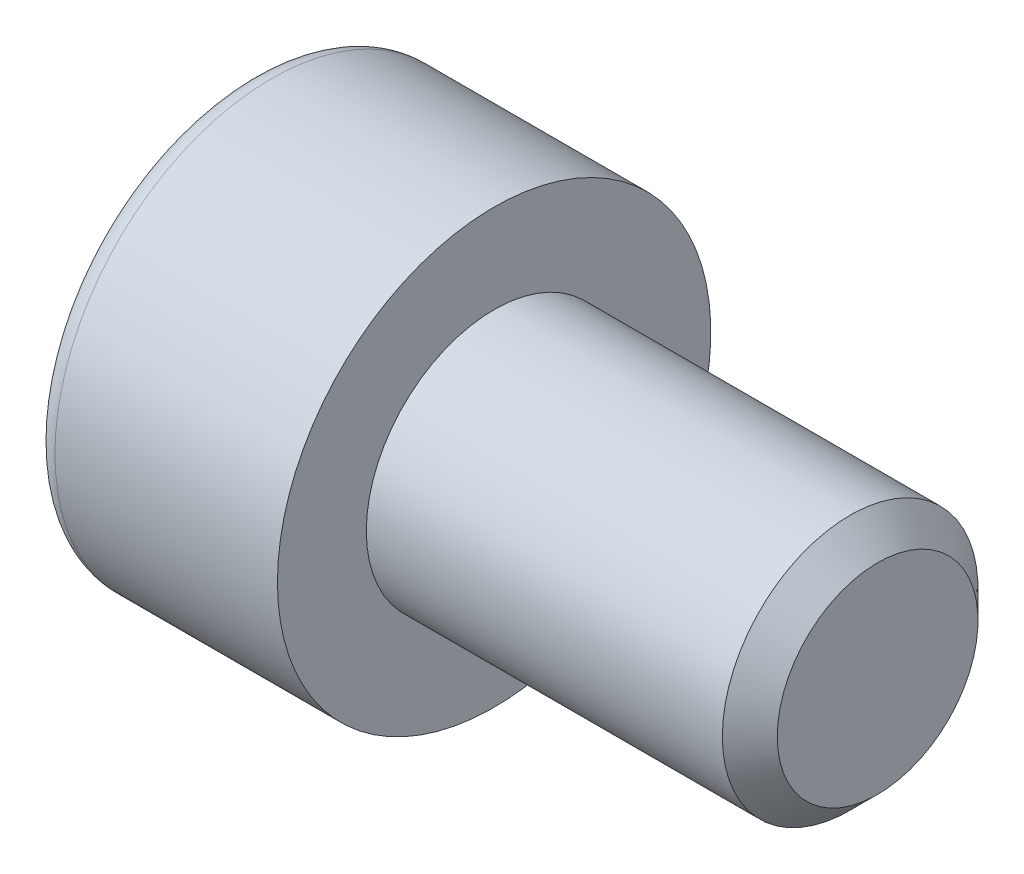
ISO-10303-21;
HEADER;
FILE_DESCRIPTION(('STEP AP214'),'2;1');
FILE_NAME('part.step','',(''),(''),'','','');
FILE_SCHEMA(('AUTOMOTIVE_DESIGN { 1 0 10303 214 1 1 1 1 }'));
ENDSEC;
DATA;
#1=APPLICATION_CONTEXT('core data for automotive mechanical design processes');
#2=APPLICATION_PROTOCOL_DEFINITION('international standard','automotive_design',2000,#1);
#3=PRODUCT_CONTEXT('',#1,'mechanical');
#4=PRODUCT('Part','Part','',(#3));
#5=PRODUCT_RELATED_PRODUCT_CATEGORY('part','',(#4));
#6=PRODUCT_DEFINITION_FORMATION('','',#4);
#7=PRODUCT_DEFINITION_CONTEXT('part definition',#1,'design');
#8=PRODUCT_DEFINITION('design','',#6,#7);
#9=PRODUCT_DEFINITION_SHAPE('','',#8);
#10=(LENGTH_UNIT() NAMED_UNIT(*) SI_UNIT(.MILLI.,.METRE.));
#11=(NAMED_UNIT(*) PLANE_ANGLE_UNIT() SI_UNIT($,.RADIAN.));
#12=(NAMED_UNIT(*) SI_UNIT($,.STERADIAN.) SOLID_ANGLE_UNIT());
#13=UNCERTAINTY_MEASURE_WITH_UNIT(LENGTH_MEASURE(1.E-05),#10,'distance_accuracy_value','');
#14=(GEOMETRIC_REPRESENTATION_CONTEXT(3) GLOBAL_UNCERTAINTY_ASSIGNED_CONTEXT((#13)) GLOBAL_UNIT_ASSIGNED_CONTEXT((#10,
#11,#12)) REPRESENTATION_CONTEXT('',''));
#15=CARTESIAN_POINT('',(0.,0.,0.));
#16=DIRECTION('',(0.,0.,1.));
#17=DIRECTION('',(1.,0.,0.));
#18=AXIS2_PLACEMENT_3D('',#15,#16,#17);
#19=CARTESIAN_POINT('',(0.,0.,0.));
#20=DIRECTION('',(-1.,0.,0.));
#21=DIRECTION('',(0.,0.,1.));
#22=AXIS2_PLACEMENT_3D('',#19,#20,#21);
#23=PLANE('',#22);
#24=CARTESIAN_POINT('',(0.,0.,0.));
#25=DIRECTION('',(-1.,0.,0.));
#26=DIRECTION('',(0.,0.,1.));
#27=AXIS2_PLACEMENT_3D('',#24,#25,#26);
#28=CIRCLE('',#27,3.39);
#29=CARTESIAN_POINT('',(0.,0.,3.39));
#30=VERTEX_POINT('',#29);
#31=EDGE_CURVE('E108',#30,#30,#28,.T.);
#32=ORIENTED_EDGE('',*,*,#31,.F.);
#33=EDGE_LOOP('',(#32));
#34=FACE_BOUND('',#33,.T.);
#35=CARTESIAN_POINT('',(0.,0.,0.));
#36=DIRECTION('',(-1.,0.,0.));
#37=DIRECTION('',(0.,0.,1.));
#38=AXIS2_PLACEMENT_3D('',#35,#36,#37);
#39=CIRCLE('',#38,2.);
#40=CARTESIAN_POINT('',(0.,0.,2.));
#41=VERTEX_POINT('',#40);
#42=EDGE_CURVE('E11',#41,#41,#39,.F.);
#43=ORIENTED_EDGE('',*,*,#42,.F.);
#44=EDGE_LOOP('',(#43));
#45=FACE_BOUND('',#44,.T.);
#46=ADVANCED_FACE('F16',(#34,#45),#23,.F.);
#47=CARTESIAN_POINT('',(-3.82,3.051,0.));
#48=DIRECTION('',(1.,0.,0.));
#49=DIRECTION('',(0.,0.,-1.));
#50=AXIS2_PLACEMENT_3D('',#47,#48,#49);
#51=PLANE('',#50);
#52=CARTESIAN_POINT('',(-3.82,0.,0.));
#53=DIRECTION('',(-1.,0.,0.));
#54=DIRECTION('',(0.,0.,1.));
#55=AXIS2_PLACEMENT_3D('',#52,#53,#54);
#56=CIRCLE('',#55,3.051);
#57=CARTESIAN_POINT('',(-3.82,0.,3.051));
#58=VERTEX_POINT('',#57);
#59=EDGE_CURVE('E91',#58,#58,#56,.T.);
#60=ORIENTED_EDGE('',*,*,#59,.T.);
#61=EDGE_LOOP('',(#60));
#62=FACE_BOUND('',#61,.T.);
#63=DIRECTION('',(0.,0.5,0.866025403784439));
#64=VECTOR('',#63,1.);
#65=CARTESIAN_POINT('',(-3.82,-0.536288105676657,2.07112175347316));
#66=LINE('',#65,#64);
#67=CARTESIAN_POINT('',(-3.82,-1.73205080756888,0.));
#68=VERTEX_POINT('',#67);
#69=CARTESIAN_POINT('',(-3.82,-0.866025403784438,1.5));
#70=VERTEX_POINT('',#69);
#71=EDGE_CURVE('E25',#68,#70,#66,.T.);
#72=ORIENTED_EDGE('',*,*,#71,.F.);
#73=DIRECTION('',(0.,-0.5,0.866025403784439));
#74=VECTOR('',#73,1.);
#75=CARTESIAN_POINT('',(-3.82,-0.536288105676658,-2.07112175347316));
#76=LINE('',#75,#74);
#77=CARTESIAN_POINT('',(-3.82,-0.866025403784439,-1.5));
#78=VERTEX_POINT('',#77);
#79=EDGE_CURVE('E40',#78,#68,#76,.T.);
#80=ORIENTED_EDGE('',*,*,#79,.F.);
#81=DIRECTION('',(0.,-1.,0.));
#82=VECTOR('',#81,1.);
#83=CARTESIAN_POINT('',(-3.82,3.051,-1.5));
#84=LINE('',#83,#82);
#85=CARTESIAN_POINT('',(-3.82,0.866025403784438,-1.5));
#86=VERTEX_POINT('',#85);
#87=EDGE_CURVE('E121',#86,#78,#84,.T.);
#88=ORIENTED_EDGE('',*,*,#87,.F.);
#89=DIRECTION('',(0.,-0.5,-0.866025403784439));
#90=VECTOR('',#89,1.);
#91=CARTESIAN_POINT('',(-3.82,2.06178810567666,0.571121753473161));
#92=LINE('',#91,#90);
#93=CARTESIAN_POINT('',(-3.82,1.73205080756887,0.));
#94=VERTEX_POINT('',#93);
#95=EDGE_CURVE('E118',#94,#86,#92,.T.);
#96=ORIENTED_EDGE('',*,*,#95,.F.);
#97=DIRECTION('',(0.,0.5,-0.866025403784439));
#98=VECTOR('',#97,1.);
#99=CARTESIAN_POINT('',(-3.82,2.06178810567665,-0.571121753473161));
#100=LINE('',#99,#98);
#101=CARTESIAN_POINT('',(-3.82,0.866025403784439,1.5));
#102=VERTEX_POINT('',#101);
#103=EDGE_CURVE('E115',#102,#94,#100,.T.);
#104=ORIENTED_EDGE('',*,*,#103,.F.);
#105=DIRECTION('',(0.,1.,0.));
#106=VECTOR('',#105,1.);
#107=CARTESIAN_POINT('',(-3.82,3.051,1.5));
#108=LINE('',#107,#106);
#109=EDGE_CURVE('E112',#70,#102,#108,.T.);
#110=ORIENTED_EDGE('',*,*,#109,.F.);
#111=EDGE_LOOP('',(#72,#80,#88,#96,#104,#110));
#112=FACE_BOUND('',#111,.T.);
#113=ADVANCED_FACE('F18',(#62,#112),#51,.F.);
#114=CARTESIAN_POINT('',(-3.82,0.,0.));
#115=DIRECTION('',(-1.,0.,0.));
#116=DIRECTION('',(0.,0.,1.));
#117=AXIS2_PLACEMENT_3D('',#114,#115,#116);
#118=CYLINDRICAL_SURFACE('',#117,3.39);
#119=CARTESIAN_POINT('',(-3.481,0.,0.));
#120=DIRECTION('',(-1.,0.,0.));
#121=DIRECTION('',(0.,0.,1.));
#122=AXIS2_PLACEMENT_3D('',#119,#120,#121);
#123=CIRCLE('',#122,3.39);
#124=CARTESIAN_POINT('',(-3.481,0.,3.39));
#125=VERTEX_POINT('',#124);
#126=EDGE_CURVE('E98',#125,#125,#123,.T.);
#127=ORIENTED_EDGE('',*,*,#126,.F.);
#128=EDGE_LOOP('',(#127));
#129=FACE_BOUND('',#128,.T.);
#130=ORIENTED_EDGE('',*,*,#31,.T.);
#131=EDGE_LOOP('',(#130));
#132=FACE_BOUND('',#131,.T.);
#133=ADVANCED_FACE('F202',(#129,#132),#118,.T.);
#134=CARTESIAN_POINT('',(-3.481,0.,0.));
#135=DIRECTION('',(-1.,0.,0.));
#136=DIRECTION('',(0.,0.,1.));
#137=AXIS2_PLACEMENT_3D('',#134,#135,#136);
#138=TOROIDAL_SURFACE('',#137,3.051,0.339);
#139=ORIENTED_EDGE('',*,*,#59,.F.);
#140=EDGE_LOOP('',(#139));
#141=FACE_BOUND('',#140,.T.);
#142=ORIENTED_EDGE('',*,*,#126,.T.);
#143=EDGE_LOOP('',(#142));
#144=FACE_BOUND('',#143,.T.);
#145=ADVANCED_FACE('F209',(#141,#144),#138,.T.);
#146=CARTESIAN_POINT('',(-1.82,-0.866025403784437,1.5));
#147=DIRECTION('',(0.,0.866025403784439,-0.5));
#148=DIRECTION('',(0.,0.5,0.866025403784439));
#149=AXIS2_PLACEMENT_3D('',#146,#147,#148);
#150=PLANE('',#149);
#151=ORIENTED_EDGE('',*,*,#71,.T.);
#152=DIRECTION('',(-1.,0.,0.));
#153=VECTOR('',#152,1.);
#154=CARTESIAN_POINT('',(-1.82,-0.866025403784437,1.5));
#155=LINE('',#154,#153);
#156=CARTESIAN_POINT('',(-1.82,-0.866025403784437,1.5));
#157=VERTEX_POINT('',#156);
#158=EDGE_CURVE('E32',#157,#70,#155,.T.);
#159=ORIENTED_EDGE('',*,*,#158,.F.);
#160=DIRECTION('',(0.,-0.5,-0.866025403784438));
#161=VECTOR('',#160,1.);
#162=CARTESIAN_POINT('',(-1.82,-0.866025403784437,1.5));
#163=LINE('',#162,#161);
#164=CARTESIAN_POINT('',(-1.82,-1.73205080756888,0.));
#165=VERTEX_POINT('',#164);
#166=EDGE_CURVE('E76',#157,#165,#163,.T.);
#167=ORIENTED_EDGE('',*,*,#166,.T.);
#168=DIRECTION('',(-1.,0.,0.));
#169=VECTOR('',#168,1.);
#170=CARTESIAN_POINT('',(-1.82,-1.73205080756888,0.));
#171=LINE('',#170,#169);
#172=EDGE_CURVE('E84',#165,#68,#171,.T.);
#173=ORIENTED_EDGE('',*,*,#172,.T.);
#174=EDGE_LOOP('',(#151,#159,#167,#173));
#175=FACE_BOUND('',#174,.T.);
#176=ADVANCED_FACE('F83',(#175),#150,.T.);
#177=CARTESIAN_POINT('',(-1.82,-1.73205080756888,0.));
#178=DIRECTION('',(0.,0.866025403784439,0.5));
#179=DIRECTION('',(0.,-0.5,0.866025403784439));
#180=AXIS2_PLACEMENT_3D('',#177,#178,#179);
#181=PLANE('',#180);
#182=ORIENTED_EDGE('',*,*,#79,.T.);
#183=ORIENTED_EDGE('',*,*,#172,.F.);
#184=DIRECTION('',(0.,0.5,-0.866025403784439));
#185=VECTOR('',#184,1.);
#186=CARTESIAN_POINT('',(-1.82,-1.73205080756888,0.));
#187=LINE('',#186,#185);
#188=CARTESIAN_POINT('',(-1.82,-0.866025403784439,-1.5));
#189=VERTEX_POINT('',#188);
#190=EDGE_CURVE('E72',#165,#189,#187,.T.);
#191=ORIENTED_EDGE('',*,*,#190,.T.);
#192=DIRECTION('',(-1.,0.,0.));
#193=VECTOR('',#192,1.);
#194=CARTESIAN_POINT('',(-1.82,-0.866025403784439,-1.5));
#195=LINE('',#194,#193);
#196=EDGE_CURVE('E92',#189,#78,#195,.T.);
#197=ORIENTED_EDGE('',*,*,#196,.T.);
#198=EDGE_LOOP('',(#182,#183,#191,#197));
#199=FACE_BOUND('',#198,.T.);
#200=ADVANCED_FACE('F89',(#199),#181,.T.);
#201=CARTESIAN_POINT('',(-1.82,-0.866025403784439,-1.5));
#202=DIRECTION('',(0.,0.,1.));
#203=DIRECTION('',(0.,-1.,0.));
#204=AXIS2_PLACEMENT_3D('',#201,#202,#203);
#205=PLANE('',#204);
#206=ORIENTED_EDGE('',*,*,#87,.T.);
#207=ORIENTED_EDGE('',*,*,#196,.F.);
#208=DIRECTION('',(0.,1.,0.));
#209=VECTOR('',#208,1.);
#210=CARTESIAN_POINT('',(-1.82,-0.866025403784439,-1.5));
#211=LINE('',#210,#209);
#212=CARTESIAN_POINT('',(-1.82,0.866025403784438,-1.5));
#213=VERTEX_POINT('',#212);
#214=EDGE_CURVE('E78',#189,#213,#211,.T.);
#215=ORIENTED_EDGE('',*,*,#214,.T.);
#216=DIRECTION('',(-1.,0.,0.));
#217=VECTOR('',#216,1.);
#218=CARTESIAN_POINT('',(-1.82,0.866025403784438,-1.5));
#219=LINE('',#218,#217);
#220=EDGE_CURVE('E101',#213,#86,#219,.T.);
#221=ORIENTED_EDGE('',*,*,#220,.T.);
#222=EDGE_LOOP('',(#206,#207,#215,#221));
#223=FACE_BOUND('',#222,.T.);
#224=ADVANCED_FACE('F160',(#223),#205,.T.);
#225=CARTESIAN_POINT('',(-1.82,0.866025403784438,-1.5));
#226=DIRECTION('',(0.,-0.866025403784439,0.5));
#227=DIRECTION('',(0.,-0.5,-0.866025403784439));
#228=AXIS2_PLACEMENT_3D('',#225,#226,#227);
#229=PLANE('',#228);
#230=ORIENTED_EDGE('',*,*,#95,.T.);
#231=ORIENTED_EDGE('',*,*,#220,.F.);
#232=DIRECTION('',(0.,0.5,0.866025403784439));
#233=VECTOR('',#232,1.);
#234=CARTESIAN_POINT('',(-1.82,0.866025403784438,-1.5));
#235=LINE('',#234,#233);
#236=CARTESIAN_POINT('',(-1.82,1.73205080756887,0.));
#237=VERTEX_POINT('',#236);
#238=EDGE_CURVE('E163',#213,#237,#235,.T.);
#239=ORIENTED_EDGE('',*,*,#238,.T.);
#240=DIRECTION('',(-1.,0.,0.));
#241=VECTOR('',#240,1.);
#242=CARTESIAN_POINT('',(-1.82,1.73205080756887,0.));
#243=LINE('',#242,#241);
#244=EDGE_CURVE('E142',#237,#94,#243,.T.);
#245=ORIENTED_EDGE('',*,*,#244,.T.);
#246=EDGE_LOOP('',(#230,#231,#239,#245));
#247=FACE_BOUND('',#246,.T.);
#248=ADVANCED_FACE('F162',(#247),#229,.T.);
#249=CARTESIAN_POINT('',(-1.82,1.73205080756888,0.));
#250=DIRECTION('',(0.,-0.866025403784439,-0.5));
#251=DIRECTION('',(0.,0.5,-0.866025403784439));
#252=AXIS2_PLACEMENT_3D('',#249,#250,#251);
#253=PLANE('',#252);
#254=ORIENTED_EDGE('',*,*,#103,.T.);
#255=ORIENTED_EDGE('',*,*,#244,.F.);
#256=DIRECTION('',(0.,-0.5,0.866025403784439));
#257=VECTOR('',#256,1.);
#258=CARTESIAN_POINT('',(-1.82,1.73205080756888,0.));
#259=LINE('',#258,#257);
#260=CARTESIAN_POINT('',(-1.82,0.866025403784439,1.5));
#261=VERTEX_POINT('',#260);
#262=EDGE_CURVE('E140',#237,#261,#259,.T.);
#263=ORIENTED_EDGE('',*,*,#262,.T.);
#264=DIRECTION('',(-1.,0.,0.));
#265=VECTOR('',#264,1.);
#266=CARTESIAN_POINT('',(-1.82,0.866025403784439,1.5));
#267=LINE('',#266,#265);
#268=EDGE_CURVE('E134',#261,#102,#267,.T.);
#269=ORIENTED_EDGE('',*,*,#268,.T.);
#270=EDGE_LOOP('',(#254,#255,#263,#269));
#271=FACE_BOUND('',#270,.T.);
#272=ADVANCED_FACE('F136',(#271),#253,.T.);
#273=CARTESIAN_POINT('',(-1.82,0.86602540378444,1.5));
#274=DIRECTION('',(0.,0.,-1.));
#275=DIRECTION('',(0.,1.,0.));
#276=AXIS2_PLACEMENT_3D('',#273,#274,#275);
#277=PLANE('',#276);
#278=ORIENTED_EDGE('',*,*,#109,.T.);
#279=ORIENTED_EDGE('',*,*,#268,.F.);
#280=DIRECTION('',(0.,-1.,0.));
#281=VECTOR('',#280,1.);
#282=CARTESIAN_POINT('',(-1.82,0.86602540378444,1.5));
#283=LINE('',#282,#281);
#284=EDGE_CURVE('E150',#261,#157,#283,.T.);
#285=ORIENTED_EDGE('',*,*,#284,.T.);
#286=ORIENTED_EDGE('',*,*,#158,.T.);
#287=EDGE_LOOP('',(#278,#279,#285,#286));
#288=FACE_BOUND('',#287,.T.);
#289=ADVANCED_FACE('F133',(#288),#277,.T.);
#290=CARTESIAN_POINT('',(-1.82,-1.73205080756888,0.));
#291=DIRECTION('',(1.,0.,0.));
#292=DIRECTION('',(0.,0.,1.));
#293=AXIS2_PLACEMENT_3D('',#290,#291,#292);
#294=PLANE('',#293);
#295=ORIENTED_EDGE('',*,*,#166,.F.);
#296=ORIENTED_EDGE('',*,*,#284,.F.);
#297=ORIENTED_EDGE('',*,*,#262,.F.);
#298=ORIENTED_EDGE('',*,*,#238,.F.);
#299=ORIENTED_EDGE('',*,*,#214,.F.);
#300=ORIENTED_EDGE('',*,*,#190,.F.);
#301=EDGE_LOOP('',(#295,#296,#297,#298,#299,#300));
#302=FACE_BOUND('',#301,.T.);
#303=ADVANCED_FACE('F74',(#302),#294,.F.);
#304=CARTESIAN_POINT('',(0.,0.,0.));
#305=DIRECTION('',(-1.,0.,0.));
#306=DIRECTION('',(0.,0.,1.));
#307=AXIS2_PLACEMENT_3D('',#304,#305,#306);
#308=CYLINDRICAL_SURFACE('',#307,2.);
#309=CARTESIAN_POINT('',(5.5705,0.,0.));
#310=DIRECTION('',(-1.,0.,0.));
#311=DIRECTION('',(0.,0.,1.));
#312=AXIS2_PLACEMENT_3D('',#309,#310,#311);
#313=CIRCLE('',#312,2.);
#314=CARTESIAN_POINT('',(5.5705,0.,2.));
#315=VERTEX_POINT('',#314);
#316=EDGE_CURVE('E173',#315,#315,#313,.T.);
#317=ORIENTED_EDGE('',*,*,#316,.T.);
#318=EDGE_LOOP('',(#317));
#319=FACE_BOUND('',#318,.T.);
#320=ORIENTED_EDGE('',*,*,#42,.T.);
#321=EDGE_LOOP('',(#320));
#322=FACE_BOUND('',#321,.T.);
#323=ADVANCED_FACE('F179',(#319,#322),#308,.T.);
#324=CARTESIAN_POINT('',(6.,0.,0.));
#325=DIRECTION('',(-1.,0.,0.));
#326=DIRECTION('',(0.,0.,1.));
#327=AXIS2_PLACEMENT_3D('',#324,#325,#326);
#328=PLANE('',#327);
#329=CARTESIAN_POINT('',(6.,0.,0.));
#330=DIRECTION('',(-1.,0.,0.));
#331=DIRECTION('',(0.,0.,1.));
#332=AXIS2_PLACEMENT_3D('',#329,#330,#331);
#333=CIRCLE('',#332,1.5705);
#334=CARTESIAN_POINT('',(6.,0.,1.5705));
#335=VERTEX_POINT('',#334);
#336=EDGE_CURVE('E87',#335,#335,#333,.T.);
#337=ORIENTED_EDGE('',*,*,#336,.F.);
#338=EDGE_LOOP('',(#337));
#339=FACE_BOUND('',#338,.T.);
#340=ADVANCED_FACE('F185',(#339),#328,.F.);
#341=CARTESIAN_POINT('',(6.,0.,0.));
#342=DIRECTION('',(-1.,0.,0.));
#343=DIRECTION('',(0.,0.,1.));
#344=AXIS2_PLACEMENT_3D('',#341,#342,#343);
#345=CONICAL_SURFACE('',#344,1.5705,0.785398163397448);
#346=ORIENTED_EDGE('',*,*,#316,.F.);
#347=EDGE_LOOP('',(#346));
#348=FACE_BOUND('',#347,.T.);
#349=ORIENTED_EDGE('',*,*,#336,.T.);
#350=EDGE_LOOP('',(#349));
#351=FACE_BOUND('',#350,.T.);
#352=ADVANCED_FACE('F182',(#348,#351),#345,.T.);
#353=CLOSED_SHELL('',(#46,#113,#133,#145,#176,#200,#224,#248,#272,#289,#303,#323,#340,#352));
#354=MANIFOLD_SOLID_BREP('B1',#353);
#355=ADVANCED_BREP_SHAPE_REPRESENTATION('',(#18,#354),#14);
#356=SHAPE_DEFINITION_REPRESENTATION(#9,#355);
ENDSEC;
END-ISO-10303-21;
